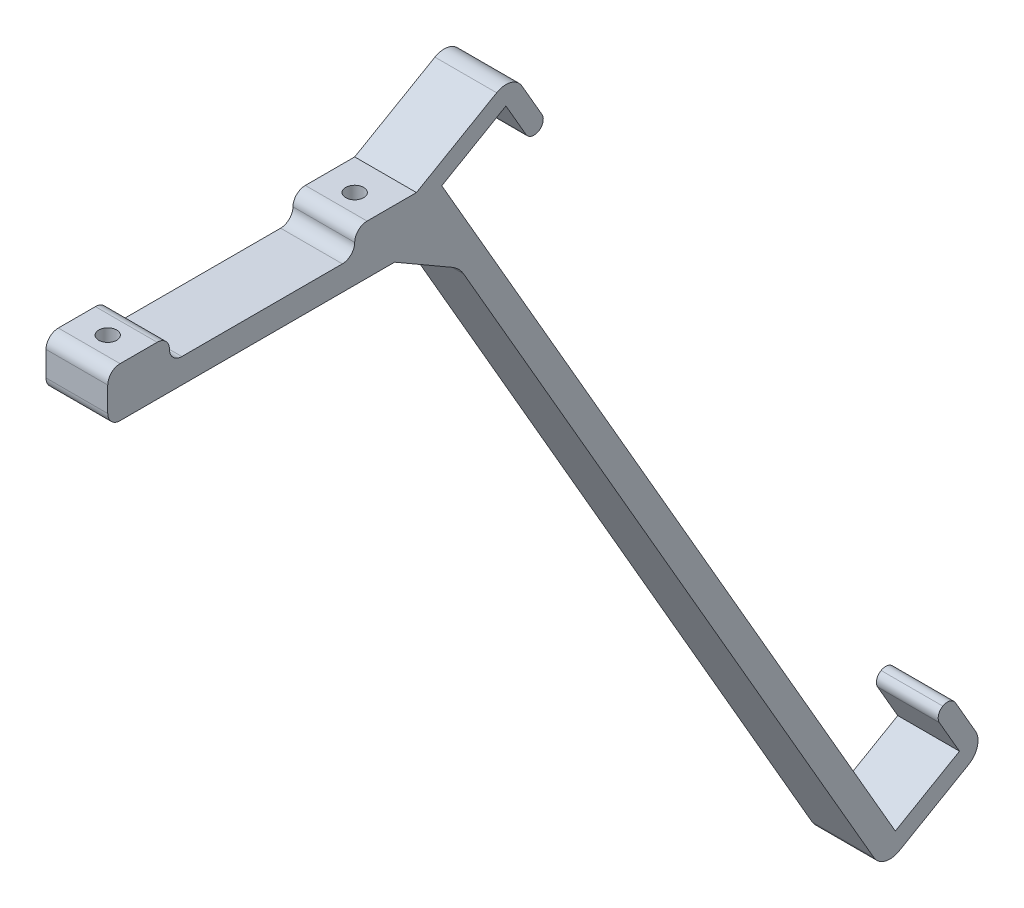
ISO-10303-21;
HEADER;
FILE_DESCRIPTION(('STEP AP214'),'2;1');
FILE_NAME('part.step','',(''),(''),'','','');
FILE_SCHEMA(('AUTOMOTIVE_DESIGN { 1 0 10303 214 1 1 1 1 }'));
ENDSEC;
DATA;
#1=APPLICATION_CONTEXT('core data for automotive mechanical design processes');
#2=APPLICATION_PROTOCOL_DEFINITION('international standard','automotive_design',2000,#1);
#3=PRODUCT_CONTEXT('',#1,'mechanical');
#4=PRODUCT('Part','Part','',(#3));
#5=PRODUCT_RELATED_PRODUCT_CATEGORY('part','',(#4));
#6=PRODUCT_DEFINITION_FORMATION('','',#4);
#7=PRODUCT_DEFINITION_CONTEXT('part definition',#1,'design');
#8=PRODUCT_DEFINITION('design','',#6,#7);
#9=PRODUCT_DEFINITION_SHAPE('','',#8);
#10=(LENGTH_UNIT() NAMED_UNIT(*) SI_UNIT(.MILLI.,.METRE.));
#11=(NAMED_UNIT(*) PLANE_ANGLE_UNIT() SI_UNIT($,.RADIAN.));
#12=(NAMED_UNIT(*) SI_UNIT($,.STERADIAN.) SOLID_ANGLE_UNIT());
#13=UNCERTAINTY_MEASURE_WITH_UNIT(LENGTH_MEASURE(1.E-05),#10,'distance_accuracy_value','');
#14=(GEOMETRIC_REPRESENTATION_CONTEXT(3) GLOBAL_UNCERTAINTY_ASSIGNED_CONTEXT((#13)) GLOBAL_UNIT_ASSIGNED_CONTEXT((#10,
#11,#12)) REPRESENTATION_CONTEXT('',''));
#15=CARTESIAN_POINT('',(0.,0.,0.));
#16=DIRECTION('',(0.,0.,1.));
#17=DIRECTION('',(1.,0.,0.));
#18=AXIS2_PLACEMENT_3D('',#15,#16,#17);
#19=CARTESIAN_POINT('',(10.,-124.439708952528,-101.464101615138));
#20=DIRECTION('',(0.,-0.866025403784444,-0.499999999999991));
#21=DIRECTION('',(0.,0.499999999999991,-0.866025403784444));
#22=AXIS2_PLACEMENT_3D('',#19,#20,#21);
#23=PLANE('',#22);
#24=DIRECTION('',(0.,-0.499999999999991,0.866025403784444));
#25=VECTOR('',#24,1.);
#26=CARTESIAN_POINT('',(10.,-124.439708952528,-101.464101615138));
#27=LINE('',#26,#25);
#28=CARTESIAN_POINT('',(10.,-116.939708952528,-114.454482671904));
#29=VERTEX_POINT('',#28);
#30=CARTESIAN_POINT('',(10.,-123.439708952528,-103.196152422707));
#31=VERTEX_POINT('',#30);
#32=EDGE_CURVE('E326',#29,#31,#27,.T.);
#33=ORIENTED_EDGE('',*,*,#32,.T.);
#34=DIRECTION('',(1.,0.,0.));
#35=VECTOR('',#34,1.);
#36=CARTESIAN_POINT('',(0.,-123.439708952528,-103.196152422707));
#37=LINE('',#36,#35);
#38=CARTESIAN_POINT('',(0.,-123.439708952528,-103.196152422707));
#39=VERTEX_POINT('',#38);
#40=EDGE_CURVE('E441',#31,#39,#37,.F.);
#41=ORIENTED_EDGE('',*,*,#40,.T.);
#42=DIRECTION('',(0.,-0.499999999999991,0.866025403784444));
#43=VECTOR('',#42,1.);
#44=CARTESIAN_POINT('',(0.,-124.439708952528,-101.464101615138));
#45=LINE('',#44,#43);
#46=CARTESIAN_POINT('',(0.,-116.939708952528,-114.454482671904));
#47=VERTEX_POINT('',#46);
#48=EDGE_CURVE('E323',#47,#39,#45,.T.);
#49=ORIENTED_EDGE('',*,*,#48,.F.);
#50=DIRECTION('',(1.,0.,0.));
#51=VECTOR('',#50,1.);
#52=CARTESIAN_POINT('',(10.,-116.939708952528,-114.454482671904));
#53=LINE('',#52,#51);
#54=EDGE_CURVE('E438',#47,#29,#53,.T.);
#55=ORIENTED_EDGE('',*,*,#54,.T.);
#56=EDGE_LOOP('',(#33,#41,#49,#55));
#57=FACE_BOUND('',#56,.T.);
#58=ADVANCED_FACE('F36',(#57),#23,.T.);
#59=CARTESIAN_POINT('',(10.,4.,-25.));
#60=DIRECTION('',(0.,1.,0.));
#61=DIRECTION('',(0.,0.,1.));
#62=AXIS2_PLACEMENT_3D('',#59,#60,#61);
#63=PLANE('',#62);
#64=DIRECTION('',(0.,0.,-1.));
#65=VECTOR('',#64,1.);
#66=CARTESIAN_POINT('',(0.,4.,-25.));
#67=LINE('',#66,#65);
#68=CARTESIAN_POINT('',(0.,4.,13.));
#69=VERTEX_POINT('',#68);
#70=CARTESIAN_POINT('',(0.,4.,-13.));
#71=VERTEX_POINT('',#70);
#72=EDGE_CURVE('E341',#69,#71,#67,.T.);
#73=ORIENTED_EDGE('',*,*,#72,.F.);
#74=DIRECTION('',(1.,0.,0.));
#75=VECTOR('',#74,1.);
#76=CARTESIAN_POINT('',(10.,4.,13.));
#77=LINE('',#76,#75);
#78=CARTESIAN_POINT('',(10.,4.,13.));
#79=VERTEX_POINT('',#78);
#80=EDGE_CURVE('E379',#69,#79,#77,.T.);
#81=ORIENTED_EDGE('',*,*,#80,.T.);
#82=DIRECTION('',(0.,0.,-1.));
#83=VECTOR('',#82,1.);
#84=CARTESIAN_POINT('',(10.,4.,-25.));
#85=LINE('',#84,#83);
#86=CARTESIAN_POINT('',(10.,4.,-13.));
#87=VERTEX_POINT('',#86);
#88=EDGE_CURVE('E329',#79,#87,#85,.T.);
#89=ORIENTED_EDGE('',*,*,#88,.T.);
#90=DIRECTION('',(1.,0.,0.));
#91=VECTOR('',#90,1.);
#92=CARTESIAN_POINT('',(0.,4.,-13.));
#93=LINE('',#92,#91);
#94=EDGE_CURVE('E376',#87,#71,#93,.F.);
#95=ORIENTED_EDGE('',*,*,#94,.T.);
#96=EDGE_LOOP('',(#73,#81,#89,#95));
#97=FACE_BOUND('',#96,.T.);
#98=ADVANCED_FACE('F493',(#97),#63,.T.);
#99=CARTESIAN_POINT('',(10.,0.,25.));
#100=DIRECTION('',(0.,0.,1.));
#101=DIRECTION('',(1.,0.,0.));
#102=AXIS2_PLACEMENT_3D('',#99,#100,#101);
#103=PLANE('',#102);
#104=DIRECTION('',(0.,1.,0.));
#105=VECTOR('',#104,1.);
#106=CARTESIAN_POINT('',(0.,0.,25.));
#107=LINE('',#106,#105);
#108=CARTESIAN_POINT('',(0.,2.,25.));
#109=VERTEX_POINT('',#108);
#110=CARTESIAN_POINT('',(0.,5.99999999999997,25.));
#111=VERTEX_POINT('',#110);
#112=EDGE_CURVE('E344',#109,#111,#107,.T.);
#113=ORIENTED_EDGE('',*,*,#112,.F.);
#114=DIRECTION('',(-1.,0.,0.));
#115=VECTOR('',#114,1.);
#116=CARTESIAN_POINT('',(10.,2.,25.));
#117=LINE('',#116,#115);
#118=CARTESIAN_POINT('',(10.,2.,25.));
#119=VERTEX_POINT('',#118);
#120=EDGE_CURVE('E361',#109,#119,#117,.F.);
#121=ORIENTED_EDGE('',*,*,#120,.T.);
#122=DIRECTION('',(0.,1.,0.));
#123=VECTOR('',#122,1.);
#124=CARTESIAN_POINT('',(10.,0.,25.));
#125=LINE('',#124,#123);
#126=CARTESIAN_POINT('',(10.,5.99999999999997,25.));
#127=VERTEX_POINT('',#126);
#128=EDGE_CURVE('E333',#119,#127,#125,.T.);
#129=ORIENTED_EDGE('',*,*,#128,.T.);
#130=DIRECTION('',(1.,0.,0.));
#131=VECTOR('',#130,1.);
#132=CARTESIAN_POINT('',(10.,5.99999999999997,25.));
#133=LINE('',#132,#131);
#134=EDGE_CURVE('E359',#127,#111,#133,.F.);
#135=ORIENTED_EDGE('',*,*,#134,.T.);
#136=EDGE_LOOP('',(#113,#121,#129,#135));
#137=FACE_BOUND('',#136,.T.);
#138=ADVANCED_FACE('F499',(#137),#103,.T.);
#139=CARTESIAN_POINT('',(10.,0.,-25.));
#140=DIRECTION('',(0.,1.,0.));
#141=DIRECTION('',(0.,0.,1.));
#142=AXIS2_PLACEMENT_3D('',#139,#140,#141);
#143=PLANE('',#142);
#144=CARTESIAN_POINT('',(5.,0.,20.));
#145=DIRECTION('',(0.,-1.,0.));
#146=DIRECTION('',(0.,0.,-1.));
#147=AXIS2_PLACEMENT_3D('',#144,#145,#146);
#148=CIRCLE('',#147,1.45);
#149=CARTESIAN_POINT('',(5.,0.,18.55));
#150=VERTEX_POINT('',#149);
#151=EDGE_CURVE('E297',#150,#150,#148,.T.);
#152=ORIENTED_EDGE('',*,*,#151,.F.);
#153=EDGE_LOOP('',(#152));
#154=FACE_BOUND('',#153,.T.);
#155=CARTESIAN_POINT('',(5.00000000000001,0.,-20.));
#156=DIRECTION('',(0.,-1.,0.));
#157=DIRECTION('',(0.,0.,-1.));
#158=AXIS2_PLACEMENT_3D('',#155,#156,#157);
#159=CIRCLE('',#158,1.45);
#160=CARTESIAN_POINT('',(5.00000000000001,0.,-21.45));
#161=VERTEX_POINT('',#160);
#162=EDGE_CURVE('E304',#161,#161,#159,.T.);
#163=ORIENTED_EDGE('',*,*,#162,.F.);
#164=EDGE_LOOP('',(#163));
#165=FACE_BOUND('',#164,.T.);
#166=DIRECTION('',(0.,0.,-1.));
#167=VECTOR('',#166,1.);
#168=CARTESIAN_POINT('',(0.,0.,-25.));
#169=LINE('',#168,#167);
#170=CARTESIAN_POINT('',(0.,0.,23.));
#171=VERTEX_POINT('',#170);
#172=CARTESIAN_POINT('',(0.,0.,-21.4641016151378));
#173=VERTEX_POINT('',#172);
#174=EDGE_CURVE('E330',#171,#173,#169,.T.);
#175=ORIENTED_EDGE('',*,*,#174,.T.);
#176=DIRECTION('',(1.,0.,0.));
#177=VECTOR('',#176,1.);
#178=CARTESIAN_POINT('',(10.,0.,-21.4641016151378));
#179=LINE('',#178,#177);
#180=CARTESIAN_POINT('',(10.,0.,-21.4641016151378));
#181=VERTEX_POINT('',#180);
#182=EDGE_CURVE('E456',#173,#181,#179,.T.);
#183=ORIENTED_EDGE('',*,*,#182,.T.);
#184=DIRECTION('',(0.,0.,-1.));
#185=VECTOR('',#184,1.);
#186=CARTESIAN_POINT('',(10.,0.,-25.));
#187=LINE('',#186,#185);
#188=CARTESIAN_POINT('',(10.,0.,23.));
#189=VERTEX_POINT('',#188);
#190=EDGE_CURVE('E336',#189,#181,#187,.T.);
#191=ORIENTED_EDGE('',*,*,#190,.F.);
#192=DIRECTION('',(-1.,0.,0.));
#193=VECTOR('',#192,1.);
#194=CARTESIAN_POINT('',(0.,0.,23.));
#195=LINE('',#194,#193);
#196=EDGE_CURVE('E339',#189,#171,#195,.T.);
#197=ORIENTED_EDGE('',*,*,#196,.T.);
#198=EDGE_LOOP('',(#175,#183,#191,#197));
#199=FACE_BOUND('',#198,.T.);
#200=ADVANCED_FACE('F604',(#154,#165,#199),#143,.F.);
#201=CARTESIAN_POINT('',(10.,0.,0.));
#202=DIRECTION('',(-1.,0.,0.));
#203=DIRECTION('',(0.,0.,1.));
#204=AXIS2_PLACEMENT_3D('',#201,#202,#203);
#205=PLANE('',#204);
#206=DIRECTION('',(0.,0.866025403784439,0.5));
#207=VECTOR('',#206,1.);
#208=CARTESIAN_POINT('',(10.,-124.939708952528,-100.598076211353));
#209=LINE('',#208,#207);
#210=CARTESIAN_POINT('',(10.,-122.341632741175,-99.0980762113534));
#211=VERTEX_POINT('',#210);
#212=CARTESIAN_POINT('',(10.,-7.22243186433541,-32.6339745962155));
#213=VERTEX_POINT('',#212);
#214=EDGE_CURVE('E259',#211,#213,#209,.T.);
#215=ORIENTED_EDGE('',*,*,#214,.F.);
#216=CARTESIAN_POINT('',(10.,-120.841632741175,-101.696152422707));
#217=DIRECTION('',(-1.,0.,0.));
#218=DIRECTION('',(0.,0.,1.));
#219=AXIS2_PLACEMENT_3D('',#216,#217,#218);
#220=CIRCLE('',#219,3.);
#221=EDGE_CURVE('E436',#211,#31,#220,.F.);
#222=ORIENTED_EDGE('',*,*,#221,.T.);
#223=ORIENTED_EDGE('',*,*,#32,.F.);
#224=CARTESIAN_POINT('',(10.,-114.341632741175,-112.954482671904));
#225=DIRECTION('',(-1.,0.,0.));
#226=DIRECTION('',(0.,0.,1.));
#227=AXIS2_PLACEMENT_3D('',#224,#225,#226);
#228=CIRCLE('',#227,3.);
#229=CARTESIAN_POINT('',(10.,-112.841632741175,-115.552558883258));
#230=VERTEX_POINT('',#229);
#231=EDGE_CURVE('E434',#29,#230,#228,.F.);
#232=ORIENTED_EDGE('',*,*,#231,.T.);
#233=DIRECTION('',(0.,0.866025403784438,0.500000000000001));
#234=VECTOR('',#233,1.);
#235=CARTESIAN_POINT('',(10.,-115.439708952528,-117.052558883258));
#236=LINE('',#235,#234);
#237=CARTESIAN_POINT('',(10.,-107.212467616576,-112.302558883258));
#238=VERTEX_POINT('',#237);
#239=EDGE_CURVE('E266',#230,#238,#236,.T.);
#240=ORIENTED_EDGE('',*,*,#239,.T.);
#241=CARTESIAN_POINT('',(10.,-107.962467616576,-111.003520777581));
#242=DIRECTION('',(-1.,0.,0.));
#243=DIRECTION('',(0.,0.,1.));
#244=AXIS2_PLACEMENT_3D('',#241,#242,#243);
#245=CIRCLE('',#244,1.5);
#246=CARTESIAN_POINT('',(10.,-106.663429510899,-110.253520777581));
#247=VERTEX_POINT('',#246);
#248=EDGE_CURVE('E400',#238,#247,#245,.F.);
#249=ORIENTED_EDGE('',*,*,#248,.T.);
#250=CARTESIAN_POINT('',(10.,-107.962467616576,-111.003520777581));
#251=DIRECTION('',(-1.,0.,0.));
#252=DIRECTION('',(0.,0.,1.));
#253=AXIS2_PLACEMENT_3D('',#250,#251,#252);
#254=CIRCLE('',#253,1.5);
#255=CARTESIAN_POINT('',(10.,-108.712467616576,-109.704482671904));
#256=VERTEX_POINT('',#255);
#257=EDGE_CURVE('E402',#247,#256,#254,.F.);
#258=ORIENTED_EDGE('',*,*,#257,.T.);
#259=DIRECTION('',(0.,-0.866025403784438,-0.500000000000001));
#260=VECTOR('',#259,1.);
#261=CARTESIAN_POINT('',(10.,-107.413429510899,-108.954482671904));
#262=LINE('',#261,#260);
#263=CARTESIAN_POINT('',(10.,-114.341632741175,-112.954482671904));
#264=VERTEX_POINT('',#263);
#265=EDGE_CURVE('E263',#256,#264,#262,.T.);
#266=ORIENTED_EDGE('',*,*,#265,.T.);
#267=DIRECTION('',(0.,-0.499999999999997,0.866025403784441));
#268=VECTOR('',#267,1.);
#269=CARTESIAN_POINT('',(10.,-114.341632741175,-112.954482671904));
#270=LINE('',#269,#268);
#271=CARTESIAN_POINT('',(10.,-120.341632741175,-102.562177826491));
#272=VERTEX_POINT('',#271);
#273=EDGE_CURVE('E268',#264,#272,#270,.T.);
#274=ORIENTED_EDGE('',*,*,#273,.T.);
#275=DIRECTION('',(0.,0.866025403784438,0.5));
#276=VECTOR('',#275,1.);
#277=CARTESIAN_POINT('',(10.,-120.341632741175,-102.562177826491));
#278=LINE('',#277,#276);
#279=CARTESIAN_POINT('',(10.,6.90192378864665,-29.0980762113533));
#280=VERTEX_POINT('',#279);
#281=EDGE_CURVE('E257',#272,#280,#278,.T.);
#282=ORIENTED_EDGE('',*,*,#281,.T.);
#283=DIRECTION('',(0.,0.500000000000005,-0.866025403784436));
#284=VECTOR('',#283,1.);
#285=CARTESIAN_POINT('',(10.,12.9019237886467,-39.4903810567666));
#286=LINE('',#285,#284);
#287=CARTESIAN_POINT('',(10.,12.9019237886467,-39.4903810567666));
#288=VERTEX_POINT('',#287);
#289=EDGE_CURVE('E241',#280,#288,#286,.T.);
#290=ORIENTED_EDGE('',*,*,#289,.T.);
#291=DIRECTION('',(0.,-0.866025403784439,-0.499999999999999));
#292=VECTOR('',#291,1.);
#293=CARTESIAN_POINT('',(10.,5.97372055837116,-43.4903810567666));
#294=LINE('',#293,#292);
#295=CARTESIAN_POINT('',(10.,7.27275866404782,-42.7403810567666));
#296=VERTEX_POINT('',#295);
#297=EDGE_CURVE('E280',#288,#296,#294,.T.);
#298=ORIENTED_EDGE('',*,*,#297,.T.);
#299=CARTESIAN_POINT('',(10.,8.02275866404782,-44.0394191624432));
#300=DIRECTION('',(-1.,0.,0.));
#301=DIRECTION('',(0.,0.,1.));
#302=AXIS2_PLACEMENT_3D('',#299,#300,#301);
#303=CIRCLE('',#302,1.5);
#304=CARTESIAN_POINT('',(10.,6.72372055837116,-44.7894191624432));
#305=VERTEX_POINT('',#304);
#306=EDGE_CURVE('E398',#296,#305,#303,.F.);
#307=ORIENTED_EDGE('',*,*,#306,.T.);
#308=CARTESIAN_POINT('',(10.,8.02275866404782,-44.0394191624432));
#309=DIRECTION('',(-1.,0.,0.));
#310=DIRECTION('',(0.,0.,1.));
#311=AXIS2_PLACEMENT_3D('',#308,#309,#310);
#312=CIRCLE('',#311,1.5);
#313=CARTESIAN_POINT('',(10.,8.77275866404782,-45.3384572681199));
#314=VERTEX_POINT('',#313);
#315=EDGE_CURVE('E392',#305,#314,#312,.F.);
#316=ORIENTED_EDGE('',*,*,#315,.T.);
#317=DIRECTION('',(0.,0.866025403784439,0.5));
#318=VECTOR('',#317,1.);
#319=CARTESIAN_POINT('',(10.,17.0000000000001,-40.5884572681199));
#320=LINE('',#319,#318);
#321=CARTESIAN_POINT('',(10.,14.4019237886467,-42.0884572681199));
#322=VERTEX_POINT('',#321);
#323=EDGE_CURVE('E277',#314,#322,#320,.T.);
#324=ORIENTED_EDGE('',*,*,#323,.T.);
#325=CARTESIAN_POINT('',(10.,12.9019237886467,-39.4903810567665));
#326=DIRECTION('',(-1.,0.,0.));
#327=DIRECTION('',(0.,0.,1.));
#328=AXIS2_PLACEMENT_3D('',#325,#326,#327);
#329=CIRCLE('',#328,3.);
#330=CARTESIAN_POINT('',(10.,15.5,-37.9903810567665));
#331=VERTEX_POINT('',#330);
#332=EDGE_CURVE('E432',#322,#331,#329,.F.);
#333=ORIENTED_EDGE('',*,*,#332,.T.);
#334=DIRECTION('',(0.,-0.500000000000004,0.866025403784436));
#335=VECTOR('',#334,1.);
#336=CARTESIAN_POINT('',(10.,7.99999999999997,-25.));
#337=LINE('',#336,#335);
#338=CARTESIAN_POINT('',(10.,7.99999999999997,-25.));
#339=VERTEX_POINT('',#338);
#340=EDGE_CURVE('E275',#331,#339,#337,.T.);
#341=ORIENTED_EDGE('',*,*,#340,.T.);
#342=DIRECTION('',(0.,0.,1.));
#343=VECTOR('',#342,1.);
#344=CARTESIAN_POINT('',(10.,7.99999999999997,-25.));
#345=LINE('',#344,#343);
#346=CARTESIAN_POINT('',(10.,7.99999999999997,-17.));
#347=VERTEX_POINT('',#346);
#348=EDGE_CURVE('E316',#339,#347,#345,.T.);
#349=ORIENTED_EDGE('',*,*,#348,.T.);
#350=CARTESIAN_POINT('',(10.,5.99999999999997,-17.));
#351=DIRECTION('',(-1.,0.,0.));
#352=DIRECTION('',(0.,0.,1.));
#353=AXIS2_PLACEMENT_3D('',#350,#351,#352);
#354=CIRCLE('',#353,2.);
#355=CARTESIAN_POINT('',(10.,5.99999999999997,-15.));
#356=VERTEX_POINT('',#355);
#357=EDGE_CURVE('E363',#347,#356,#354,.F.);
#358=ORIENTED_EDGE('',*,*,#357,.T.);
#359=CARTESIAN_POINT('',(10.,6.,-13.));
#360=DIRECTION('',(-1.,0.,0.));
#361=DIRECTION('',(0.,0.,1.));
#362=AXIS2_PLACEMENT_3D('',#359,#360,#361);
#363=CIRCLE('',#362,2.);
#364=EDGE_CURVE('E388',#356,#87,#363,.T.);
#365=ORIENTED_EDGE('',*,*,#364,.T.);
#366=ORIENTED_EDGE('',*,*,#88,.F.);
#367=CARTESIAN_POINT('',(10.,6.,13.));
#368=DIRECTION('',(-1.,0.,0.));
#369=DIRECTION('',(0.,0.,1.));
#370=AXIS2_PLACEMENT_3D('',#367,#368,#369);
#371=CIRCLE('',#370,2.);
#372=CARTESIAN_POINT('',(10.,5.99999999999997,15.));
#373=VERTEX_POINT('',#372);
#374=EDGE_CURVE('E384',#79,#373,#371,.T.);
#375=ORIENTED_EDGE('',*,*,#374,.T.);
#376=CARTESIAN_POINT('',(10.,5.99999999999997,17.));
#377=DIRECTION('',(-1.,0.,0.));
#378=DIRECTION('',(0.,0.,1.));
#379=AXIS2_PLACEMENT_3D('',#376,#377,#378);
#380=CIRCLE('',#379,2.);
#381=CARTESIAN_POINT('',(10.,7.99999999999997,17.));
#382=VERTEX_POINT('',#381);
#383=EDGE_CURVE('E365',#373,#382,#380,.F.);
#384=ORIENTED_EDGE('',*,*,#383,.T.);
#385=DIRECTION('',(0.,0.,1.));
#386=VECTOR('',#385,1.);
#387=CARTESIAN_POINT('',(10.,7.99999999999997,25.));
#388=LINE('',#387,#386);
#389=CARTESIAN_POINT('',(10.,7.99999999999997,23.));
#390=VERTEX_POINT('',#389);
#391=EDGE_CURVE('E300',#382,#390,#388,.T.);
#392=ORIENTED_EDGE('',*,*,#391,.T.);
#393=CARTESIAN_POINT('',(10.,5.99999999999997,23.));
#394=DIRECTION('',(-1.,0.,0.));
#395=DIRECTION('',(0.,0.,1.));
#396=AXIS2_PLACEMENT_3D('',#393,#394,#395);
#397=CIRCLE('',#396,2.);
#398=EDGE_CURVE('E367',#390,#127,#397,.F.);
#399=ORIENTED_EDGE('',*,*,#398,.T.);
#400=ORIENTED_EDGE('',*,*,#128,.F.);
#401=CARTESIAN_POINT('',(10.,2.,23.));
#402=DIRECTION('',(-1.,0.,0.));
#403=DIRECTION('',(0.,0.,1.));
#404=AXIS2_PLACEMENT_3D('',#401,#402,#403);
#405=CIRCLE('',#404,2.);
#406=EDGE_CURVE('E369',#119,#189,#405,.F.);
#407=ORIENTED_EDGE('',*,*,#406,.T.);
#408=ORIENTED_EDGE('',*,*,#190,.T.);
#409=DIRECTION('',(0.,0.500000000000001,0.866025403784438));
#410=VECTOR('',#409,1.);
#411=CARTESIAN_POINT('',(10.,9.29422863405999,-5.36602540378447));
#412=LINE('',#411,#410);
#413=CARTESIAN_POINT('',(10.,-5.39230484541323,-30.8038475772934));
#414=VERTEX_POINT('',#413);
#415=EDGE_CURVE('E459',#181,#414,#412,.F.);
#416=ORIENTED_EDGE('',*,*,#415,.T.);
#417=CARTESIAN_POINT('',(10.,-9.72243186433541,-28.3038475772933));
#418=DIRECTION('',(-1.,0.,0.));
#419=DIRECTION('',(0.,0.,1.));
#420=AXIS2_PLACEMENT_3D('',#417,#418,#419);
#421=CIRCLE('',#420,5.);
#422=EDGE_CURVE('E11',#414,#213,#421,.T.);
#423=ORIENTED_EDGE('',*,*,#422,.T.);
#424=EDGE_LOOP('',(#215,#222,#223,#232,#240,#249,#258,#266,#274,#282,#290,#298,#307,#316,#324,
#333,#341,#349,#358,#365,#366,#375,#384,#392,#399,#400,#407,#408,#416,#423));
#425=FACE_BOUND('',#424,.T.);
#426=ADVANCED_FACE('F484',(#425),#205,.F.);
#427=CARTESIAN_POINT('',(0.,0.,0.));
#428=DIRECTION('',(-1.,0.,0.));
#429=DIRECTION('',(0.,0.,1.));
#430=AXIS2_PLACEMENT_3D('',#427,#428,#429);
#431=PLANE('',#430);
#432=ORIENTED_EDGE('',*,*,#48,.T.);
#433=CARTESIAN_POINT('',(0.,-120.841632741175,-101.696152422707));
#434=DIRECTION('',(-1.,0.,0.));
#435=DIRECTION('',(0.,0.,1.));
#436=AXIS2_PLACEMENT_3D('',#433,#434,#435);
#437=CIRCLE('',#436,3.);
#438=CARTESIAN_POINT('',(0.,-122.341632741175,-99.0980762113534));
#439=VERTEX_POINT('',#438);
#440=EDGE_CURVE('E447',#39,#439,#437,.T.);
#441=ORIENTED_EDGE('',*,*,#440,.T.);
#442=DIRECTION('',(0.,0.866025403784439,0.5));
#443=VECTOR('',#442,1.);
#444=CARTESIAN_POINT('',(0.,-124.939708952528,-100.598076211353));
#445=LINE('',#444,#443);
#446=CARTESIAN_POINT('',(0.,-7.22243186433535,-32.6339745962155));
#447=VERTEX_POINT('',#446);
#448=EDGE_CURVE('E471',#439,#447,#445,.T.);
#449=ORIENTED_EDGE('',*,*,#448,.T.);
#450=CARTESIAN_POINT('',(0.,-9.72243186433541,-28.3038475772933));
#451=DIRECTION('',(-1.,0.,0.));
#452=DIRECTION('',(0.,0.,1.));
#453=AXIS2_PLACEMENT_3D('',#450,#451,#452);
#454=CIRCLE('',#453,5.);
#455=CARTESIAN_POINT('',(0.,-5.39230484541323,-30.8038475772933));
#456=VERTEX_POINT('',#455);
#457=EDGE_CURVE('E44',#447,#456,#454,.F.);
#458=ORIENTED_EDGE('',*,*,#457,.T.);
#459=DIRECTION('',(0.,-0.500000000000001,-0.866025403784438));
#460=VECTOR('',#459,1.);
#461=CARTESIAN_POINT('',(0.,0.,-21.4641016151378));
#462=LINE('',#461,#460);
#463=EDGE_CURVE('E461',#456,#173,#462,.F.);
#464=ORIENTED_EDGE('',*,*,#463,.T.);
#465=ORIENTED_EDGE('',*,*,#174,.F.);
#466=CARTESIAN_POINT('',(0.,2.,23.));
#467=DIRECTION('',(-1.,0.,0.));
#468=DIRECTION('',(0.,0.,1.));
#469=AXIS2_PLACEMENT_3D('',#466,#467,#468);
#470=CIRCLE('',#469,2.);
#471=EDGE_CURVE('E357',#171,#109,#470,.T.);
#472=ORIENTED_EDGE('',*,*,#471,.T.);
#473=ORIENTED_EDGE('',*,*,#112,.T.);
#474=CARTESIAN_POINT('',(0.,5.99999999999997,23.));
#475=DIRECTION('',(-1.,0.,0.));
#476=DIRECTION('',(0.,0.,1.));
#477=AXIS2_PLACEMENT_3D('',#474,#475,#476);
#478=CIRCLE('',#477,2.);
#479=CARTESIAN_POINT('',(0.,7.99999999999997,23.));
#480=VERTEX_POINT('',#479);
#481=EDGE_CURVE('E355',#111,#480,#478,.T.);
#482=ORIENTED_EDGE('',*,*,#481,.T.);
#483=DIRECTION('',(0.,0.,1.));
#484=VECTOR('',#483,1.);
#485=CARTESIAN_POINT('',(0.,7.99999999999997,25.));
#486=LINE('',#485,#484);
#487=CARTESIAN_POINT('',(0.,7.99999999999997,17.));
#488=VERTEX_POINT('',#487);
#489=EDGE_CURVE('E313',#488,#480,#486,.T.);
#490=ORIENTED_EDGE('',*,*,#489,.F.);
#491=CARTESIAN_POINT('',(0.,5.99999999999997,17.));
#492=DIRECTION('',(-1.,0.,0.));
#493=DIRECTION('',(0.,0.,1.));
#494=AXIS2_PLACEMENT_3D('',#491,#492,#493);
#495=CIRCLE('',#494,2.);
#496=CARTESIAN_POINT('',(0.,5.99999999999997,15.));
#497=VERTEX_POINT('',#496);
#498=EDGE_CURVE('E353',#488,#497,#495,.T.);
#499=ORIENTED_EDGE('',*,*,#498,.T.);
#500=CARTESIAN_POINT('',(0.,6.,13.));
#501=DIRECTION('',(-1.,0.,0.));
#502=DIRECTION('',(0.,0.,1.));
#503=AXIS2_PLACEMENT_3D('',#500,#501,#502);
#504=CIRCLE('',#503,2.);
#505=EDGE_CURVE('E386',#497,#69,#504,.F.);
#506=ORIENTED_EDGE('',*,*,#505,.T.);
#507=ORIENTED_EDGE('',*,*,#72,.T.);
#508=CARTESIAN_POINT('',(0.,6.,-13.));
#509=DIRECTION('',(-1.,0.,0.));
#510=DIRECTION('',(0.,0.,1.));
#511=AXIS2_PLACEMENT_3D('',#508,#509,#510);
#512=CIRCLE('',#511,2.);
#513=CARTESIAN_POINT('',(0.,5.99999999999997,-15.));
#514=VERTEX_POINT('',#513);
#515=EDGE_CURVE('E390',#71,#514,#512,.F.);
#516=ORIENTED_EDGE('',*,*,#515,.T.);
#517=CARTESIAN_POINT('',(0.,5.99999999999997,-17.));
#518=DIRECTION('',(-1.,0.,0.));
#519=DIRECTION('',(0.,0.,1.));
#520=AXIS2_PLACEMENT_3D('',#517,#518,#519);
#521=CIRCLE('',#520,2.);
#522=CARTESIAN_POINT('',(0.,7.99999999999997,-17.));
#523=VERTEX_POINT('',#522);
#524=EDGE_CURVE('E351',#514,#523,#521,.T.);
#525=ORIENTED_EDGE('',*,*,#524,.T.);
#526=DIRECTION('',(0.,0.,1.));
#527=VECTOR('',#526,1.);
#528=CARTESIAN_POINT('',(0.,7.99999999999997,-25.));
#529=LINE('',#528,#527);
#530=CARTESIAN_POINT('',(0.,7.99999999999997,-25.));
#531=VERTEX_POINT('',#530);
#532=EDGE_CURVE('E320',#531,#523,#529,.T.);
#533=ORIENTED_EDGE('',*,*,#532,.F.);
#534=DIRECTION('',(0.,-0.500000000000004,0.866025403784436));
#535=VECTOR('',#534,1.);
#536=CARTESIAN_POINT('',(0.,7.99999999999997,-25.));
#537=LINE('',#536,#535);
#538=CARTESIAN_POINT('',(0.,15.5,-37.9903810567665));
#539=VERTEX_POINT('',#538);
#540=EDGE_CURVE('E286',#539,#531,#537,.T.);
#541=ORIENTED_EDGE('',*,*,#540,.F.);
#542=CARTESIAN_POINT('',(0.,12.9019237886467,-39.4903810567665));
#543=DIRECTION('',(-1.,0.,0.));
#544=DIRECTION('',(0.,0.,1.));
#545=AXIS2_PLACEMENT_3D('',#542,#543,#544);
#546=CIRCLE('',#545,3.);
#547=CARTESIAN_POINT('',(0.,14.4019237886467,-42.0884572681199));
#548=VERTEX_POINT('',#547);
#549=EDGE_CURVE('E443',#539,#548,#546,.T.);
#550=ORIENTED_EDGE('',*,*,#549,.T.);
#551=DIRECTION('',(0.,0.866025403784439,0.5));
#552=VECTOR('',#551,1.);
#553=CARTESIAN_POINT('',(0.,17.0000000000001,-40.5884572681199));
#554=LINE('',#553,#552);
#555=CARTESIAN_POINT('',(0.,8.77275866404782,-45.3384572681199));
#556=VERTEX_POINT('',#555);
#557=EDGE_CURVE('E289',#556,#548,#554,.T.);
#558=ORIENTED_EDGE('',*,*,#557,.F.);
#559=CARTESIAN_POINT('',(0.,8.02275866404782,-44.0394191624432));
#560=DIRECTION('',(-1.,0.,0.));
#561=DIRECTION('',(0.,0.,1.));
#562=AXIS2_PLACEMENT_3D('',#559,#560,#561);
#563=CIRCLE('',#562,1.5);
#564=CARTESIAN_POINT('',(0.,6.72372055837116,-44.7894191624432));
#565=VERTEX_POINT('',#564);
#566=EDGE_CURVE('E407',#556,#565,#563,.T.);
#567=ORIENTED_EDGE('',*,*,#566,.T.);
#568=CARTESIAN_POINT('',(0.,8.02275866404782,-44.0394191624432));
#569=DIRECTION('',(-1.,0.,0.));
#570=DIRECTION('',(0.,0.,1.));
#571=AXIS2_PLACEMENT_3D('',#568,#569,#570);
#572=CIRCLE('',#571,1.5);
#573=CARTESIAN_POINT('',(0.,7.27275866404782,-42.7403810567666));
#574=VERTEX_POINT('',#573);
#575=EDGE_CURVE('E409',#565,#574,#572,.T.);
#576=ORIENTED_EDGE('',*,*,#575,.T.);
#577=DIRECTION('',(0.,-0.866025403784439,-0.499999999999999));
#578=VECTOR('',#577,1.);
#579=CARTESIAN_POINT('',(0.,5.97372055837116,-43.4903810567666));
#580=LINE('',#579,#578);
#581=CARTESIAN_POINT('',(0.,12.9019237886467,-39.4903810567666));
#582=VERTEX_POINT('',#581);
#583=EDGE_CURVE('E292',#582,#574,#580,.T.);
#584=ORIENTED_EDGE('',*,*,#583,.F.);
#585=DIRECTION('',(0.,0.500000000000005,-0.866025403784436));
#586=VECTOR('',#585,1.);
#587=CARTESIAN_POINT('',(0.,12.9019237886467,-39.4903810567666));
#588=LINE('',#587,#586);
#589=CARTESIAN_POINT('',(0.,6.90192378864665,-29.0980762113533));
#590=VERTEX_POINT('',#589);
#591=EDGE_CURVE('E249',#590,#582,#588,.T.);
#592=ORIENTED_EDGE('',*,*,#591,.F.);
#593=DIRECTION('',(0.,0.866025403784438,0.5));
#594=VECTOR('',#593,1.);
#595=CARTESIAN_POINT('',(0.,-120.341632741175,-102.562177826491));
#596=LINE('',#595,#594);
#597=CARTESIAN_POINT('',(0.,-120.341632741175,-102.562177826491));
#598=VERTEX_POINT('',#597);
#599=EDGE_CURVE('E245',#598,#590,#596,.T.);
#600=ORIENTED_EDGE('',*,*,#599,.F.);
#601=DIRECTION('',(0.,-0.499999999999997,0.866025403784441));
#602=VECTOR('',#601,1.);
#603=CARTESIAN_POINT('',(0.,-114.341632741175,-112.954482671904));
#604=LINE('',#603,#602);
#605=CARTESIAN_POINT('',(0.,-114.341632741175,-112.954482671904));
#606=VERTEX_POINT('',#605);
#607=EDGE_CURVE('E231',#606,#598,#604,.T.);
#608=ORIENTED_EDGE('',*,*,#607,.F.);
#609=DIRECTION('',(0.,-0.866025403784438,-0.500000000000001));
#610=VECTOR('',#609,1.);
#611=CARTESIAN_POINT('',(0.,-107.413429510899,-108.954482671904));
#612=LINE('',#611,#610);
#613=CARTESIAN_POINT('',(0.,-108.712467616576,-109.704482671904));
#614=VERTEX_POINT('',#613);
#615=EDGE_CURVE('E271',#614,#606,#612,.T.);
#616=ORIENTED_EDGE('',*,*,#615,.F.);
#617=CARTESIAN_POINT('',(0.,-107.962467616576,-111.003520777581));
#618=DIRECTION('',(-1.,0.,0.));
#619=DIRECTION('',(0.,0.,1.));
#620=AXIS2_PLACEMENT_3D('',#617,#618,#619);
#621=CIRCLE('',#620,1.5);
#622=CARTESIAN_POINT('',(0.,-106.663429510899,-110.253520777581));
#623=VERTEX_POINT('',#622);
#624=EDGE_CURVE('E414',#614,#623,#621,.T.);
#625=ORIENTED_EDGE('',*,*,#624,.T.);
#626=CARTESIAN_POINT('',(0.,-107.962467616576,-111.003520777581));
#627=DIRECTION('',(-1.,0.,0.));
#628=DIRECTION('',(0.,0.,1.));
#629=AXIS2_PLACEMENT_3D('',#626,#627,#628);
#630=CIRCLE('',#629,1.5);
#631=CARTESIAN_POINT('',(0.,-107.212467616576,-112.302558883258));
#632=VERTEX_POINT('',#631);
#633=EDGE_CURVE('E411',#623,#632,#630,.T.);
#634=ORIENTED_EDGE('',*,*,#633,.T.);
#635=DIRECTION('',(0.,0.866025403784438,0.500000000000001));
#636=VECTOR('',#635,1.);
#637=CARTESIAN_POINT('',(0.,-115.439708952528,-117.052558883258));
#638=LINE('',#637,#636);
#639=CARTESIAN_POINT('',(0.,-112.841632741175,-115.552558883258));
#640=VERTEX_POINT('',#639);
#641=EDGE_CURVE('E265',#640,#632,#638,.T.);
#642=ORIENTED_EDGE('',*,*,#641,.F.);
#643=CARTESIAN_POINT('',(0.,-114.341632741175,-112.954482671904));
#644=DIRECTION('',(-1.,0.,0.));
#645=DIRECTION('',(0.,0.,1.));
#646=AXIS2_PLACEMENT_3D('',#643,#644,#645);
#647=CIRCLE('',#646,3.);
#648=EDGE_CURVE('E445',#640,#47,#647,.T.);
#649=ORIENTED_EDGE('',*,*,#648,.T.);
#650=EDGE_LOOP('',(#432,#441,#449,#458,#464,#465,#472,#473,#482,#490,#499,#506,#507,#516,#525,
#533,#541,#550,#558,#567,#576,#584,#592,#600,#608,#616,#625,#634,#642,#649));
#651=FACE_BOUND('',#650,.T.);
#652=ADVANCED_FACE('F247',(#651),#431,.T.);
#653=CARTESIAN_POINT('',(-12.943004089797,7.99999999999997,-25.));
#654=DIRECTION('',(0.,1.,0.));
#655=DIRECTION('',(0.,0.,1.));
#656=AXIS2_PLACEMENT_3D('',#653,#654,#655);
#657=PLANE('',#656);
#658=CARTESIAN_POINT('',(5.00000000000001,7.99999999999997,-20.));
#659=DIRECTION('',(0.,1.,0.));
#660=DIRECTION('',(0.,0.,1.));
#661=AXIS2_PLACEMENT_3D('',#658,#659,#660);
#662=CIRCLE('',#661,1.45);
#663=CARTESIAN_POINT('',(5.00000000000001,7.99999999999997,-18.55));
#664=VERTEX_POINT('',#663);
#665=EDGE_CURVE('E307',#664,#664,#662,.F.);
#666=ORIENTED_EDGE('',*,*,#665,.T.);
#667=EDGE_LOOP('',(#666));
#668=FACE_BOUND('',#667,.T.);
#669=ORIENTED_EDGE('',*,*,#532,.T.);
#670=DIRECTION('',(1.,0.,0.));
#671=VECTOR('',#670,1.);
#672=CARTESIAN_POINT('',(-12.943004089797,7.99999999999997,-17.));
#673=LINE('',#672,#671);
#674=EDGE_CURVE('E382',#523,#347,#673,.T.);
#675=ORIENTED_EDGE('',*,*,#674,.T.);
#676=ORIENTED_EDGE('',*,*,#348,.F.);
#677=DIRECTION('',(1.,0.,0.));
#678=VECTOR('',#677,1.);
#679=CARTESIAN_POINT('',(-12.943004089797,7.99999999999997,-25.));
#680=LINE('',#679,#678);
#681=EDGE_CURVE('E319',#531,#339,#680,.T.);
#682=ORIENTED_EDGE('',*,*,#681,.F.);
#683=EDGE_LOOP('',(#669,#675,#676,#682));
#684=FACE_BOUND('',#683,.T.);
#685=ADVANCED_FACE('F597',(#668,#684),#657,.T.);
#686=CARTESIAN_POINT('',(-12.943004089797,7.99999999999997,25.));
#687=DIRECTION('',(0.,1.,0.));
#688=DIRECTION('',(0.,0.,1.));
#689=AXIS2_PLACEMENT_3D('',#686,#687,#688);
#690=PLANE('',#689);
#691=CARTESIAN_POINT('',(5.,7.99999999999997,20.));
#692=DIRECTION('',(0.,1.,0.));
#693=DIRECTION('',(0.,0.,1.));
#694=AXIS2_PLACEMENT_3D('',#691,#692,#693);
#695=CIRCLE('',#694,1.45);
#696=CARTESIAN_POINT('',(5.,7.99999999999997,21.45));
#697=VERTEX_POINT('',#696);
#698=EDGE_CURVE('E301',#697,#697,#695,.F.);
#699=ORIENTED_EDGE('',*,*,#698,.T.);
#700=EDGE_LOOP('',(#699));
#701=FACE_BOUND('',#700,.T.);
#702=ORIENTED_EDGE('',*,*,#489,.T.);
#703=DIRECTION('',(1.,0.,0.));
#704=VECTOR('',#703,1.);
#705=CARTESIAN_POINT('',(-12.943004089797,7.99999999999997,23.));
#706=LINE('',#705,#704);
#707=EDGE_CURVE('E373',#480,#390,#706,.T.);
#708=ORIENTED_EDGE('',*,*,#707,.T.);
#709=ORIENTED_EDGE('',*,*,#391,.F.);
#710=DIRECTION('',(1.,0.,0.));
#711=VECTOR('',#710,1.);
#712=CARTESIAN_POINT('',(-12.943004089797,7.99999999999997,17.));
#713=LINE('',#712,#711);
#714=EDGE_CURVE('E371',#382,#488,#713,.F.);
#715=ORIENTED_EDGE('',*,*,#714,.T.);
#716=EDGE_LOOP('',(#702,#708,#709,#715));
#717=FACE_BOUND('',#716,.T.);
#718=ADVANCED_FACE('F590',(#701,#717),#690,.T.);
#719=CARTESIAN_POINT('',(5.,8.00099999999997,20.));
#720=DIRECTION('',(0.,-1.,0.));
#721=DIRECTION('',(0.,0.,-1.));
#722=AXIS2_PLACEMENT_3D('',#719,#720,#721);
#723=CYLINDRICAL_SURFACE('',#722,1.45);
#724=ORIENTED_EDGE('',*,*,#698,.F.);
#725=EDGE_LOOP('',(#724));
#726=FACE_BOUND('',#725,.T.);
#727=ORIENTED_EDGE('',*,*,#151,.T.);
#728=EDGE_LOOP('',(#727));
#729=FACE_BOUND('',#728,.T.);
#730=ADVANCED_FACE('F587',(#726,#729),#723,.F.);
#731=CARTESIAN_POINT('',(5.00000000000001,8.00099999999997,-20.));
#732=DIRECTION('',(0.,-1.,0.));
#733=DIRECTION('',(0.,0.,-1.));
#734=AXIS2_PLACEMENT_3D('',#731,#732,#733);
#735=CYLINDRICAL_SURFACE('',#734,1.45);
#736=ORIENTED_EDGE('',*,*,#665,.F.);
#737=EDGE_LOOP('',(#736));
#738=FACE_BOUND('',#737,.T.);
#739=ORIENTED_EDGE('',*,*,#162,.T.);
#740=EDGE_LOOP('',(#739));
#741=FACE_BOUND('',#740,.T.);
#742=ADVANCED_FACE('F508',(#738,#741),#735,.F.);
#743=CARTESIAN_POINT('',(10.,2.,23.));
#744=DIRECTION('',(1.,0.,0.));
#745=DIRECTION('',(0.,0.,-1.));
#746=AXIS2_PLACEMENT_3D('',#743,#744,#745);
#747=CYLINDRICAL_SURFACE('',#746,2.);
#748=ORIENTED_EDGE('',*,*,#406,.F.);
#749=ORIENTED_EDGE('',*,*,#120,.F.);
#750=ORIENTED_EDGE('',*,*,#471,.F.);
#751=ORIENTED_EDGE('',*,*,#196,.F.);
#752=EDGE_LOOP('',(#748,#749,#750,#751));
#753=FACE_BOUND('',#752,.T.);
#754=ADVANCED_FACE('F504',(#753),#747,.T.);
#755=CARTESIAN_POINT('',(-12.943004089797,5.99999999999997,23.));
#756=DIRECTION('',(1.,0.,0.));
#757=DIRECTION('',(0.,0.,-1.));
#758=AXIS2_PLACEMENT_3D('',#755,#756,#757);
#759=CYLINDRICAL_SURFACE('',#758,2.);
#760=ORIENTED_EDGE('',*,*,#481,.F.);
#761=ORIENTED_EDGE('',*,*,#134,.F.);
#762=ORIENTED_EDGE('',*,*,#398,.F.);
#763=ORIENTED_EDGE('',*,*,#707,.F.);
#764=EDGE_LOOP('',(#760,#761,#762,#763));
#765=FACE_BOUND('',#764,.T.);
#766=ADVANCED_FACE('F507',(#765),#759,.T.);
#767=CARTESIAN_POINT('',(-12.943004089797,5.99999999999997,17.));
#768=DIRECTION('',(1.,0.,0.));
#769=DIRECTION('',(0.,0.,-1.));
#770=AXIS2_PLACEMENT_3D('',#767,#768,#769);
#771=CYLINDRICAL_SURFACE('',#770,2.);
#772=DIRECTION('',(1.,0.,0.));
#773=VECTOR('',#772,1.);
#774=CARTESIAN_POINT('',(-12.943004089797,5.99999999999997,15.));
#775=LINE('',#774,#773);
#776=EDGE_CURVE('E310',#497,#373,#775,.T.);
#777=ORIENTED_EDGE('',*,*,#776,.F.);
#778=ORIENTED_EDGE('',*,*,#498,.F.);
#779=ORIENTED_EDGE('',*,*,#714,.F.);
#780=ORIENTED_EDGE('',*,*,#383,.F.);
#781=EDGE_LOOP('',(#777,#778,#779,#780));
#782=FACE_BOUND('',#781,.T.);
#783=ADVANCED_FACE('F512',(#782),#771,.T.);
#784=CARTESIAN_POINT('',(10.,6.,13.));
#785=DIRECTION('',(-1.,0.,0.));
#786=DIRECTION('',(0.,0.,1.));
#787=AXIS2_PLACEMENT_3D('',#784,#785,#786);
#788=CYLINDRICAL_SURFACE('',#787,2.);
#789=ORIENTED_EDGE('',*,*,#505,.F.);
#790=ORIENTED_EDGE('',*,*,#776,.T.);
#791=ORIENTED_EDGE('',*,*,#374,.F.);
#792=ORIENTED_EDGE('',*,*,#80,.F.);
#793=EDGE_LOOP('',(#789,#790,#791,#792));
#794=FACE_BOUND('',#793,.T.);
#795=ADVANCED_FACE('F514',(#794),#788,.F.);
#796=CARTESIAN_POINT('',(-12.943004089797,5.99999999999997,-17.));
#797=DIRECTION('',(1.,0.,0.));
#798=DIRECTION('',(0.,0.,-1.));
#799=AXIS2_PLACEMENT_3D('',#796,#797,#798);
#800=CYLINDRICAL_SURFACE('',#799,2.);
#801=ORIENTED_EDGE('',*,*,#674,.F.);
#802=ORIENTED_EDGE('',*,*,#524,.F.);
#803=DIRECTION('',(1.,0.,0.));
#804=VECTOR('',#803,1.);
#805=CARTESIAN_POINT('',(-12.943004089797,5.99999999999997,-15.));
#806=LINE('',#805,#804);
#807=EDGE_CURVE('E288',#356,#514,#806,.F.);
#808=ORIENTED_EDGE('',*,*,#807,.F.);
#809=ORIENTED_EDGE('',*,*,#357,.F.);
#810=EDGE_LOOP('',(#801,#802,#808,#809));
#811=FACE_BOUND('',#810,.T.);
#812=ADVANCED_FACE('F517',(#811),#800,.T.);
#813=CARTESIAN_POINT('',(-12.943004089797,6.,-13.));
#814=DIRECTION('',(-1.,0.,0.));
#815=DIRECTION('',(0.,0.,1.));
#816=AXIS2_PLACEMENT_3D('',#813,#814,#815);
#817=CYLINDRICAL_SURFACE('',#816,2.);
#818=ORIENTED_EDGE('',*,*,#515,.F.);
#819=ORIENTED_EDGE('',*,*,#94,.F.);
#820=ORIENTED_EDGE('',*,*,#364,.F.);
#821=ORIENTED_EDGE('',*,*,#807,.T.);
#822=EDGE_LOOP('',(#818,#819,#820,#821));
#823=FACE_BOUND('',#822,.T.);
#824=ADVANCED_FACE('F522',(#823),#817,.F.);
#825=CARTESIAN_POINT('',(-25.2039362353118,12.9019237886467,-39.4903810567666));
#826=DIRECTION('',(0.,-0.866025403784436,-0.500000000000005));
#827=DIRECTION('',(0.,0.500000000000005,-0.866025403784436));
#828=AXIS2_PLACEMENT_3D('',#825,#826,#827);
#829=PLANE('',#828);
#830=DIRECTION('',(1.,0.,0.));
#831=VECTOR('',#830,1.);
#832=CARTESIAN_POINT('',(-149.533803013419,6.90192378864665,-29.0980762113533));
#833=LINE('',#832,#831);
#834=EDGE_CURVE('E252',#590,#280,#833,.T.);
#835=ORIENTED_EDGE('',*,*,#834,.F.);
#836=ORIENTED_EDGE('',*,*,#591,.T.);
#837=DIRECTION('',(1.,0.,0.));
#838=VECTOR('',#837,1.);
#839=CARTESIAN_POINT('',(-25.2039362353118,12.9019237886467,-39.4903810567666));
#840=LINE('',#839,#838);
#841=EDGE_CURVE('E285',#582,#288,#840,.T.);
#842=ORIENTED_EDGE('',*,*,#841,.T.);
#843=ORIENTED_EDGE('',*,*,#289,.F.);
#844=EDGE_LOOP('',(#835,#836,#842,#843));
#845=FACE_BOUND('',#844,.T.);
#846=ADVANCED_FACE('F525',(#845),#829,.T.);
#847=CARTESIAN_POINT('',(-25.2039362353118,5.97372055837116,-43.4903810567666));
#848=DIRECTION('',(0.,-0.499999999999999,0.866025403784439));
#849=DIRECTION('',(0.,-0.866025403784439,-0.499999999999999));
#850=AXIS2_PLACEMENT_3D('',#847,#848,#849);
#851=PLANE('',#850);
#852=ORIENTED_EDGE('',*,*,#583,.T.);
#853=DIRECTION('',(1.,0.,0.));
#854=VECTOR('',#853,1.);
#855=CARTESIAN_POINT('',(-25.2039362353118,7.27275866404782,-42.7403810567666));
#856=LINE('',#855,#854);
#857=EDGE_CURVE('E419',#574,#296,#856,.T.);
#858=ORIENTED_EDGE('',*,*,#857,.T.);
#859=ORIENTED_EDGE('',*,*,#297,.F.);
#860=ORIENTED_EDGE('',*,*,#841,.F.);
#861=EDGE_LOOP('',(#852,#858,#859,#860));
#862=FACE_BOUND('',#861,.T.);
#863=ADVANCED_FACE('F576',(#862),#851,.T.);
#864=CARTESIAN_POINT('',(-25.2039362353118,17.0000000000001,-40.5884572681199));
#865=DIRECTION('',(0.,0.5,-0.866025403784439));
#866=DIRECTION('',(0.,0.866025403784439,0.5));
#867=AXIS2_PLACEMENT_3D('',#864,#865,#866);
#868=PLANE('',#867);
#869=ORIENTED_EDGE('',*,*,#557,.T.);
#870=DIRECTION('',(1.,0.,0.));
#871=VECTOR('',#870,1.);
#872=CARTESIAN_POINT('',(-25.2039362353118,14.4019237886467,-42.0884572681199));
#873=LINE('',#872,#871);
#874=EDGE_CURVE('E451',#548,#322,#873,.T.);
#875=ORIENTED_EDGE('',*,*,#874,.T.);
#876=ORIENTED_EDGE('',*,*,#323,.F.);
#877=DIRECTION('',(1.,0.,0.));
#878=VECTOR('',#877,1.);
#879=CARTESIAN_POINT('',(-25.2039362353118,8.77275866404782,-45.3384572681199));
#880=LINE('',#879,#878);
#881=EDGE_CURVE('E422',#314,#556,#880,.F.);
#882=ORIENTED_EDGE('',*,*,#881,.T.);
#883=EDGE_LOOP('',(#869,#875,#876,#882));
#884=FACE_BOUND('',#883,.T.);
#885=ADVANCED_FACE('F567',(#884),#868,.T.);
#886=CARTESIAN_POINT('',(-25.2039362353118,7.99999999999997,-25.));
#887=DIRECTION('',(0.,0.866025403784436,0.500000000000004));
#888=DIRECTION('',(0.,-0.500000000000004,0.866025403784436));
#889=AXIS2_PLACEMENT_3D('',#886,#887,#888);
#890=PLANE('',#889);
#891=ORIENTED_EDGE('',*,*,#340,.F.);
#892=DIRECTION('',(1.,0.,0.));
#893=VECTOR('',#892,1.);
#894=CARTESIAN_POINT('',(-25.2039362353118,15.5,-37.9903810567665));
#895=LINE('',#894,#893);
#896=EDGE_CURVE('E454',#331,#539,#895,.F.);
#897=ORIENTED_EDGE('',*,*,#896,.T.);
#898=ORIENTED_EDGE('',*,*,#540,.T.);
#899=ORIENTED_EDGE('',*,*,#681,.T.);
#900=EDGE_LOOP('',(#891,#897,#898,#899));
#901=FACE_BOUND('',#900,.T.);
#902=ADVANCED_FACE('F647',(#901),#890,.T.);
#903=CARTESIAN_POINT('',(-25.2039362353118,-115.439708952528,-117.052558883258));
#904=DIRECTION('',(0.,0.500000000000001,-0.866025403784438));
#905=DIRECTION('',(0.,0.866025403784438,0.500000000000001));
#906=AXIS2_PLACEMENT_3D('',#903,#904,#905);
#907=PLANE('',#906);
#908=ORIENTED_EDGE('',*,*,#239,.F.);
#909=DIRECTION('',(1.,0.,0.));
#910=VECTOR('',#909,1.);
#911=CARTESIAN_POINT('',(-25.2039362353118,-112.841632741175,-115.552558883258));
#912=LINE('',#911,#910);
#913=EDGE_CURVE('E449',#230,#640,#912,.F.);
#914=ORIENTED_EDGE('',*,*,#913,.T.);
#915=ORIENTED_EDGE('',*,*,#641,.T.);
#916=DIRECTION('',(1.,0.,0.));
#917=VECTOR('',#916,1.);
#918=CARTESIAN_POINT('',(-25.2039362353118,-107.212467616576,-112.302558883258));
#919=LINE('',#918,#917);
#920=EDGE_CURVE('E416',#632,#238,#919,.T.);
#921=ORIENTED_EDGE('',*,*,#920,.T.);
#922=EDGE_LOOP('',(#908,#914,#915,#921));
#923=FACE_BOUND('',#922,.T.);
#924=ADVANCED_FACE('F649',(#923),#907,.T.);
#925=CARTESIAN_POINT('',(-25.2039362353118,-107.413429510899,-108.954482671904));
#926=DIRECTION('',(0.,-0.500000000000001,0.866025403784438));
#927=DIRECTION('',(0.,-0.866025403784438,-0.500000000000001));
#928=AXIS2_PLACEMENT_3D('',#925,#926,#927);
#929=PLANE('',#928);
#930=ORIENTED_EDGE('',*,*,#265,.F.);
#931=DIRECTION('',(1.,0.,0.));
#932=VECTOR('',#931,1.);
#933=CARTESIAN_POINT('',(-25.2039362353118,-108.712467616576,-109.704482671904));
#934=LINE('',#933,#932);
#935=EDGE_CURVE('E404',#256,#614,#934,.F.);
#936=ORIENTED_EDGE('',*,*,#935,.T.);
#937=ORIENTED_EDGE('',*,*,#615,.T.);
#938=DIRECTION('',(1.,0.,0.));
#939=VECTOR('',#938,1.);
#940=CARTESIAN_POINT('',(-25.2039362353118,-114.341632741175,-112.954482671904));
#941=LINE('',#940,#939);
#942=EDGE_CURVE('E239',#606,#264,#941,.T.);
#943=ORIENTED_EDGE('',*,*,#942,.T.);
#944=EDGE_LOOP('',(#930,#936,#937,#943));
#945=FACE_BOUND('',#944,.T.);
#946=ADVANCED_FACE('F655',(#945),#929,.T.);
#947=CARTESIAN_POINT('',(-25.2039362353118,-114.341632741175,-112.954482671904));
#948=DIRECTION('',(0.,0.866025403784441,0.499999999999997));
#949=DIRECTION('',(0.,-0.499999999999997,0.866025403784441));
#950=AXIS2_PLACEMENT_3D('',#947,#948,#949);
#951=PLANE('',#950);
#952=DIRECTION('',(1.,0.,0.));
#953=VECTOR('',#952,1.);
#954=CARTESIAN_POINT('',(-149.533803013419,-120.341632741175,-102.562177826491));
#955=LINE('',#954,#953);
#956=EDGE_CURVE('E236',#598,#272,#955,.T.);
#957=ORIENTED_EDGE('',*,*,#956,.T.);
#958=ORIENTED_EDGE('',*,*,#273,.F.);
#959=ORIENTED_EDGE('',*,*,#942,.F.);
#960=ORIENTED_EDGE('',*,*,#607,.T.);
#961=EDGE_LOOP('',(#957,#958,#959,#960));
#962=FACE_BOUND('',#961,.T.);
#963=ADVANCED_FACE('F233',(#962),#951,.T.);
#964=CARTESIAN_POINT('',(-25.2039362353118,-107.962467616576,-111.003520777581));
#965=DIRECTION('',(1.,0.,0.));
#966=DIRECTION('',(0.,0.,-1.));
#967=AXIS2_PLACEMENT_3D('',#964,#965,#966);
#968=CYLINDRICAL_SURFACE('',#967,1.5);
#969=ORIENTED_EDGE('',*,*,#920,.F.);
#970=ORIENTED_EDGE('',*,*,#633,.F.);
#971=DIRECTION('',(1.,0.,0.));
#972=VECTOR('',#971,1.);
#973=CARTESIAN_POINT('',(-25.2039362353118,-106.663429510899,-110.253520777581));
#974=LINE('',#973,#972);
#975=EDGE_CURVE('E269',#247,#623,#974,.F.);
#976=ORIENTED_EDGE('',*,*,#975,.F.);
#977=ORIENTED_EDGE('',*,*,#248,.F.);
#978=EDGE_LOOP('',(#969,#970,#976,#977));
#979=FACE_BOUND('',#978,.T.);
#980=ADVANCED_FACE('F534',(#979),#968,.T.);
#981=CARTESIAN_POINT('',(-25.2039362353118,-107.962467616576,-111.003520777581));
#982=DIRECTION('',(1.,0.,0.));
#983=DIRECTION('',(0.,0.,-1.));
#984=AXIS2_PLACEMENT_3D('',#981,#982,#983);
#985=CYLINDRICAL_SURFACE('',#984,1.5);
#986=ORIENTED_EDGE('',*,*,#624,.F.);
#987=ORIENTED_EDGE('',*,*,#935,.F.);
#988=ORIENTED_EDGE('',*,*,#257,.F.);
#989=ORIENTED_EDGE('',*,*,#975,.T.);
#990=EDGE_LOOP('',(#986,#987,#988,#989));
#991=FACE_BOUND('',#990,.T.);
#992=ADVANCED_FACE('F530',(#991),#985,.T.);
#993=CARTESIAN_POINT('',(-25.2039362353118,8.02275866404782,-44.0394191624432));
#994=DIRECTION('',(1.,0.,0.));
#995=DIRECTION('',(0.,0.,-1.));
#996=AXIS2_PLACEMENT_3D('',#993,#994,#995);
#997=CYLINDRICAL_SURFACE('',#996,1.5);
#998=DIRECTION('',(1.,0.,0.));
#999=VECTOR('',#998,1.);
#1000=CARTESIAN_POINT('',(-25.2039362353118,6.72372055837116,-44.7894191624432));
#1001=LINE('',#1000,#999);
#1002=EDGE_CURVE('E427',#565,#305,#1001,.T.);
#1003=ORIENTED_EDGE('',*,*,#1002,.F.);
#1004=ORIENTED_EDGE('',*,*,#566,.F.);
#1005=ORIENTED_EDGE('',*,*,#881,.F.);
#1006=ORIENTED_EDGE('',*,*,#315,.F.);
#1007=EDGE_LOOP('',(#1003,#1004,#1005,#1006));
#1008=FACE_BOUND('',#1007,.T.);
#1009=ADVANCED_FACE('F533',(#1008),#997,.T.);
#1010=CARTESIAN_POINT('',(-25.2039362353118,8.02275866404782,-44.0394191624432));
#1011=DIRECTION('',(1.,0.,0.));
#1012=DIRECTION('',(0.,0.,-1.));
#1013=AXIS2_PLACEMENT_3D('',#1010,#1011,#1012);
#1014=CYLINDRICAL_SURFACE('',#1013,1.5);
#1015=ORIENTED_EDGE('',*,*,#575,.F.);
#1016=ORIENTED_EDGE('',*,*,#1002,.T.);
#1017=ORIENTED_EDGE('',*,*,#306,.F.);
#1018=ORIENTED_EDGE('',*,*,#857,.F.);
#1019=EDGE_LOOP('',(#1015,#1016,#1017,#1018));
#1020=FACE_BOUND('',#1019,.T.);
#1021=ADVANCED_FACE('F539',(#1020),#1014,.T.);
#1022=CARTESIAN_POINT('',(-149.533803013419,-120.341632741175,-102.562177826491));
#1023=DIRECTION('',(0.,0.5,-0.866025403784438));
#1024=DIRECTION('',(0.,0.866025403784438,0.5));
#1025=AXIS2_PLACEMENT_3D('',#1022,#1023,#1024);
#1026=PLANE('',#1025);
#1027=ORIENTED_EDGE('',*,*,#956,.F.);
#1028=ORIENTED_EDGE('',*,*,#599,.T.);
#1029=ORIENTED_EDGE('',*,*,#834,.T.);
#1030=ORIENTED_EDGE('',*,*,#281,.F.);
#1031=EDGE_LOOP('',(#1027,#1028,#1029,#1030));
#1032=FACE_BOUND('',#1031,.T.);
#1033=ADVANCED_FACE('F255',(#1032),#1026,.T.);
#1034=CARTESIAN_POINT('',(-0.000999999999999265,-124.939708952528,-100.598076211353));
#1035=DIRECTION('',(0.,0.5,-0.866025403784439));
#1036=DIRECTION('',(0.,0.866025403784439,0.5));
#1037=AXIS2_PLACEMENT_3D('',#1034,#1035,#1036);
#1038=PLANE('',#1037);
#1039=ORIENTED_EDGE('',*,*,#214,.T.);
#1040=DIRECTION('',(1.,0.,0.));
#1041=VECTOR('',#1040,1.);
#1042=CARTESIAN_POINT('',(0.,-7.22243186433542,-32.6339745962155));
#1043=LINE('',#1042,#1041);
#1044=EDGE_CURVE('E463',#213,#447,#1043,.F.);
#1045=ORIENTED_EDGE('',*,*,#1044,.T.);
#1046=ORIENTED_EDGE('',*,*,#448,.F.);
#1047=DIRECTION('',(1.,0.,0.));
#1048=VECTOR('',#1047,1.);
#1049=CARTESIAN_POINT('',(10.,-122.341632741175,-99.0980762113534));
#1050=LINE('',#1049,#1048);
#1051=EDGE_CURVE('E424',#439,#211,#1050,.T.);
#1052=ORIENTED_EDGE('',*,*,#1051,.T.);
#1053=EDGE_LOOP('',(#1039,#1045,#1046,#1052));
#1054=FACE_BOUND('',#1053,.T.);
#1055=ADVANCED_FACE('F470',(#1054),#1038,.F.);
#1056=CARTESIAN_POINT('',(-0.000999999999999265,-120.841632741175,-101.696152422707));
#1057=DIRECTION('',(-1.,0.,0.));
#1058=DIRECTION('',(0.,0.,1.));
#1059=AXIS2_PLACEMENT_3D('',#1056,#1057,#1058);
#1060=CYLINDRICAL_SURFACE('',#1059,3.);
#1061=ORIENTED_EDGE('',*,*,#440,.F.);
#1062=ORIENTED_EDGE('',*,*,#40,.F.);
#1063=ORIENTED_EDGE('',*,*,#221,.F.);
#1064=ORIENTED_EDGE('',*,*,#1051,.F.);
#1065=EDGE_LOOP('',(#1061,#1062,#1063,#1064));
#1066=FACE_BOUND('',#1065,.T.);
#1067=ADVANCED_FACE('F482',(#1066),#1060,.T.);
#1068=CARTESIAN_POINT('',(10.,-114.341632741175,-112.954482671904));
#1069=DIRECTION('',(1.,0.,0.));
#1070=DIRECTION('',(0.,0.,-1.));
#1071=AXIS2_PLACEMENT_3D('',#1068,#1069,#1070);
#1072=CYLINDRICAL_SURFACE('',#1071,3.);
#1073=ORIENTED_EDGE('',*,*,#648,.F.);
#1074=ORIENTED_EDGE('',*,*,#913,.F.);
#1075=ORIENTED_EDGE('',*,*,#231,.F.);
#1076=ORIENTED_EDGE('',*,*,#54,.F.);
#1077=EDGE_LOOP('',(#1073,#1074,#1075,#1076));
#1078=FACE_BOUND('',#1077,.T.);
#1079=ADVANCED_FACE('F548',(#1078),#1072,.T.);
#1080=CARTESIAN_POINT('',(-25.2039362353118,12.9019237886467,-39.4903810567665));
#1081=DIRECTION('',(1.,0.,0.));
#1082=DIRECTION('',(0.,0.,-1.));
#1083=AXIS2_PLACEMENT_3D('',#1080,#1081,#1082);
#1084=CYLINDRICAL_SURFACE('',#1083,3.);
#1085=ORIENTED_EDGE('',*,*,#549,.F.);
#1086=ORIENTED_EDGE('',*,*,#896,.F.);
#1087=ORIENTED_EDGE('',*,*,#332,.F.);
#1088=ORIENTED_EDGE('',*,*,#874,.F.);
#1089=EDGE_LOOP('',(#1085,#1086,#1087,#1088));
#1090=FACE_BOUND('',#1089,.T.);
#1091=ADVANCED_FACE('F491',(#1090),#1084,.T.);
#1092=CARTESIAN_POINT('',(10.,0.,-21.4641016151378));
#1093=DIRECTION('',(0.,-0.866025403784438,0.500000000000001));
#1094=DIRECTION('',(-1.,0.,0.));
#1095=AXIS2_PLACEMENT_3D('',#1092,#1093,#1094);
#1096=PLANE('',#1095);
#1097=ORIENTED_EDGE('',*,*,#463,.F.);
#1098=DIRECTION('',(-1.,0.,0.));
#1099=VECTOR('',#1098,1.);
#1100=CARTESIAN_POINT('',(10.,-5.39230484541323,-30.8038475772933));
#1101=LINE('',#1100,#1099);
#1102=EDGE_CURVE('E51',#456,#414,#1101,.F.);
#1103=ORIENTED_EDGE('',*,*,#1102,.T.);
#1104=ORIENTED_EDGE('',*,*,#415,.F.);
#1105=ORIENTED_EDGE('',*,*,#182,.F.);
#1106=EDGE_LOOP('',(#1097,#1103,#1104,#1105));
#1107=FACE_BOUND('',#1106,.T.);
#1108=ADVANCED_FACE('F487',(#1107),#1096,.T.);
#1109=CARTESIAN_POINT('',(-0.000999999999999265,-9.72243186433541,-28.3038475772933));
#1110=DIRECTION('',(-1.,0.,0.));
#1111=DIRECTION('',(0.,0.,1.));
#1112=AXIS2_PLACEMENT_3D('',#1109,#1110,#1111);
#1113=CYLINDRICAL_SURFACE('',#1112,5.);
#1114=ORIENTED_EDGE('',*,*,#422,.F.);
#1115=ORIENTED_EDGE('',*,*,#1102,.F.);
#1116=ORIENTED_EDGE('',*,*,#457,.F.);
#1117=ORIENTED_EDGE('',*,*,#1044,.F.);
#1118=EDGE_LOOP('',(#1114,#1115,#1116,#1117));
#1119=FACE_BOUND('',#1118,.T.);
#1120=ADVANCED_FACE('F38',(#1119),#1113,.F.);
#1121=CLOSED_SHELL('',(#58,#98,#138,#200,#426,#652,#685,#718,#730,#742,#754,#766,#783,#795,#812,
#824,#846,#863,#885,#902,#924,#946,#963,#980,#992,#1009,#1021,#1033,#1055,#1067,#1079,#1091,
#1108,#1120));
#1122=MANIFOLD_SOLID_BREP('B2',#1121);
#1123=ADVANCED_BREP_SHAPE_REPRESENTATION('',(#18,#1122),#14);
#1124=SHAPE_DEFINITION_REPRESENTATION(#9,#1123);
ENDSEC;
END-ISO-10303-21;
